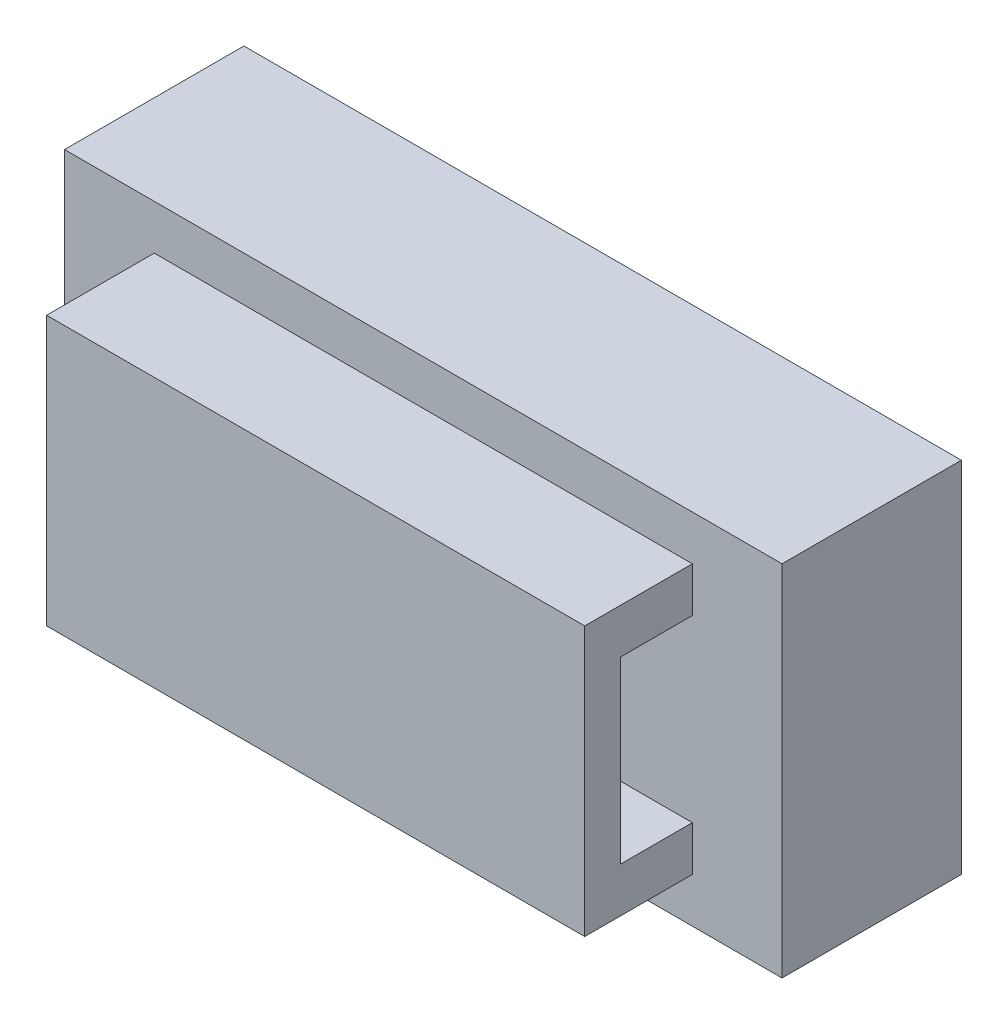
ISO-10303-21;
HEADER;
FILE_DESCRIPTION(('STEP AP214'),'2;1');
FILE_NAME('part.step','',(''),(''),'','','');
FILE_SCHEMA(('AUTOMOTIVE_DESIGN { 1 0 10303 214 1 1 1 1 }'));
ENDSEC;
DATA;
#1=APPLICATION_CONTEXT('core data for automotive mechanical design processes');
#2=APPLICATION_PROTOCOL_DEFINITION('international standard','automotive_design',2000,#1);
#3=PRODUCT_CONTEXT('',#1,'mechanical');
#4=PRODUCT('Part','Part','',(#3));
#5=PRODUCT_RELATED_PRODUCT_CATEGORY('part','',(#4));
#6=PRODUCT_DEFINITION_FORMATION('','',#4);
#7=PRODUCT_DEFINITION_CONTEXT('part definition',#1,'design');
#8=PRODUCT_DEFINITION('design','',#6,#7);
#9=PRODUCT_DEFINITION_SHAPE('','',#8);
#10=(LENGTH_UNIT() NAMED_UNIT(*) SI_UNIT(.MILLI.,.METRE.));
#11=(NAMED_UNIT(*) PLANE_ANGLE_UNIT() SI_UNIT($,.RADIAN.));
#12=(NAMED_UNIT(*) SI_UNIT($,.STERADIAN.) SOLID_ANGLE_UNIT());
#13=UNCERTAINTY_MEASURE_WITH_UNIT(LENGTH_MEASURE(1.E-05),#10,'distance_accuracy_value','');
#14=(GEOMETRIC_REPRESENTATION_CONTEXT(3) GLOBAL_UNCERTAINTY_ASSIGNED_CONTEXT((#13)) GLOBAL_UNIT_ASSIGNED_CONTEXT((#10,
#11,#12)) REPRESENTATION_CONTEXT('',''));
#15=CARTESIAN_POINT('',(0.,0.,0.));
#16=DIRECTION('',(0.,0.,1.));
#17=DIRECTION('',(1.,0.,0.));
#18=AXIS2_PLACEMENT_3D('',#15,#16,#17);
#19=CARTESIAN_POINT('',(20.,-10.,10.));
#20=DIRECTION('',(0.,0.,1.));
#21=DIRECTION('',(1.,0.,0.));
#22=AXIS2_PLACEMENT_3D('',#19,#20,#21);
#23=PLANE('',#22);
#24=DIRECTION('',(0.,-1.,0.));
#25=VECTOR('',#24,1.);
#26=CARTESIAN_POINT('',(-15.,7.5,10.));
#27=LINE('',#26,#25);
#28=CARTESIAN_POINT('',(-15.,-5.,10.));
#29=VERTEX_POINT('',#28);
#30=CARTESIAN_POINT('',(-15.,-7.5,10.));
#31=VERTEX_POINT('',#30);
#32=EDGE_CURVE('E159',#29,#31,#27,.T.);
#33=ORIENTED_EDGE('',*,*,#32,.F.);
#34=DIRECTION('',(1.,0.,0.));
#35=VECTOR('',#34,1.);
#36=CARTESIAN_POINT('',(-25.,-5.,10.));
#37=LINE('',#36,#35);
#38=CARTESIAN_POINT('',(15.,-5.,10.));
#39=VERTEX_POINT('',#38);
#40=EDGE_CURVE('E139',#29,#39,#37,.T.);
#41=ORIENTED_EDGE('',*,*,#40,.T.);
#42=DIRECTION('',(0.,1.,0.));
#43=VECTOR('',#42,1.);
#44=CARTESIAN_POINT('',(15.,7.5,10.));
#45=LINE('',#44,#43);
#46=CARTESIAN_POINT('',(15.,-7.5,10.));
#47=VERTEX_POINT('',#46);
#48=EDGE_CURVE('E155',#47,#39,#45,.T.);
#49=ORIENTED_EDGE('',*,*,#48,.F.);
#50=DIRECTION('',(1.,0.,0.));
#51=VECTOR('',#50,1.);
#52=CARTESIAN_POINT('',(-15.,-7.5,10.));
#53=LINE('',#52,#51);
#54=EDGE_CURVE('E148',#31,#47,#53,.T.);
#55=ORIENTED_EDGE('',*,*,#54,.F.);
#56=EDGE_LOOP('',(#33,#41,#49,#55));
#57=FACE_BOUND('',#56,.T.);
#58=DIRECTION('',(0.,-1.,0.));
#59=VECTOR('',#58,1.);
#60=CARTESIAN_POINT('',(-20.,10.,10.));
#61=LINE('',#60,#59);
#62=CARTESIAN_POINT('',(-20.,10.,10.));
#63=VERTEX_POINT('',#62);
#64=CARTESIAN_POINT('',(-20.,-10.,10.));
#65=VERTEX_POINT('',#64);
#66=EDGE_CURVE('E182',#63,#65,#61,.T.);
#67=ORIENTED_EDGE('',*,*,#66,.T.);
#68=DIRECTION('',(1.,0.,0.));
#69=VECTOR('',#68,1.);
#70=CARTESIAN_POINT('',(-20.,-10.,10.));
#71=LINE('',#70,#69);
#72=CARTESIAN_POINT('',(20.,-10.,10.));
#73=VERTEX_POINT('',#72);
#74=EDGE_CURVE('E184',#65,#73,#71,.T.);
#75=ORIENTED_EDGE('',*,*,#74,.T.);
#76=DIRECTION('',(0.,1.,0.));
#77=VECTOR('',#76,1.);
#78=CARTESIAN_POINT('',(20.,10.,10.));
#79=LINE('',#78,#77);
#80=CARTESIAN_POINT('',(20.,10.,10.));
#81=VERTEX_POINT('',#80);
#82=EDGE_CURVE('E176',#73,#81,#79,.T.);
#83=ORIENTED_EDGE('',*,*,#82,.T.);
#84=DIRECTION('',(-1.,0.,0.));
#85=VECTOR('',#84,1.);
#86=CARTESIAN_POINT('',(-20.,10.,10.));
#87=LINE('',#86,#85);
#88=EDGE_CURVE('E179',#81,#63,#87,.T.);
#89=ORIENTED_EDGE('',*,*,#88,.T.);
#90=EDGE_LOOP('',(#67,#75,#83,#89));
#91=FACE_BOUND('',#90,.T.);
#92=DIRECTION('',(1.,0.,0.));
#93=VECTOR('',#92,1.);
#94=CARTESIAN_POINT('',(-25.,5.,10.));
#95=LINE('',#94,#93);
#96=CARTESIAN_POINT('',(-15.,5.,10.));
#97=VERTEX_POINT('',#96);
#98=CARTESIAN_POINT('',(15.,5.,10.));
#99=VERTEX_POINT('',#98);
#100=EDGE_CURVE('E46',#97,#99,#95,.T.);
#101=ORIENTED_EDGE('',*,*,#100,.F.);
#102=CARTESIAN_POINT('',(-15.,7.5,10.));
#103=VERTEX_POINT('',#102);
#104=EDGE_CURVE('E160',#103,#97,#27,.T.);
#105=ORIENTED_EDGE('',*,*,#104,.F.);
#106=DIRECTION('',(-1.,0.,0.));
#107=VECTOR('',#106,1.);
#108=CARTESIAN_POINT('',(-15.,7.5,10.));
#109=LINE('',#108,#107);
#110=CARTESIAN_POINT('',(15.,7.5,10.));
#111=VERTEX_POINT('',#110);
#112=EDGE_CURVE('E157',#111,#103,#109,.T.);
#113=ORIENTED_EDGE('',*,*,#112,.F.);
#114=EDGE_CURVE('E141',#99,#111,#45,.T.);
#115=ORIENTED_EDGE('',*,*,#114,.F.);
#116=EDGE_LOOP('',(#101,#105,#113,#115));
#117=FACE_BOUND('',#116,.T.);
#118=ADVANCED_FACE('F31',(#57,#91,#117),#23,.T.);
#119=CARTESIAN_POINT('',(20.,10.,10.));
#120=DIRECTION('',(-1.,0.,0.));
#121=DIRECTION('',(0.,0.,1.));
#122=AXIS2_PLACEMENT_3D('',#119,#120,#121);
#123=PLANE('',#122);
#124=DIRECTION('',(0.,1.,0.));
#125=VECTOR('',#124,1.);
#126=CARTESIAN_POINT('',(20.,10.,0.));
#127=LINE('',#126,#125);
#128=CARTESIAN_POINT('',(20.,-10.,0.));
#129=VERTEX_POINT('',#128);
#130=CARTESIAN_POINT('',(20.,10.,0.));
#131=VERTEX_POINT('',#130);
#132=EDGE_CURVE('E175',#129,#131,#127,.T.);
#133=ORIENTED_EDGE('',*,*,#132,.T.);
#134=DIRECTION('',(0.,0.,-1.));
#135=VECTOR('',#134,1.);
#136=CARTESIAN_POINT('',(20.,10.,10.));
#137=LINE('',#136,#135);
#138=EDGE_CURVE('E202',#81,#131,#137,.T.);
#139=ORIENTED_EDGE('',*,*,#138,.F.);
#140=ORIENTED_EDGE('',*,*,#82,.F.);
#141=DIRECTION('',(0.,0.,-1.));
#142=VECTOR('',#141,1.);
#143=CARTESIAN_POINT('',(20.,-10.,10.));
#144=LINE('',#143,#142);
#145=EDGE_CURVE('E186',#73,#129,#144,.T.);
#146=ORIENTED_EDGE('',*,*,#145,.T.);
#147=EDGE_LOOP('',(#133,#139,#140,#146));
#148=FACE_BOUND('',#147,.T.);
#149=ADVANCED_FACE('F33',(#148),#123,.F.);
#150=CARTESIAN_POINT('',(-20.,10.,10.));
#151=DIRECTION('',(0.,-1.,0.));
#152=DIRECTION('',(0.,0.,-1.));
#153=AXIS2_PLACEMENT_3D('',#150,#151,#152);
#154=PLANE('',#153);
#155=DIRECTION('',(-1.,0.,0.));
#156=VECTOR('',#155,1.);
#157=CARTESIAN_POINT('',(-20.,10.,0.));
#158=LINE('',#157,#156);
#159=CARTESIAN_POINT('',(-20.,10.,0.));
#160=VERTEX_POINT('',#159);
#161=EDGE_CURVE('E189',#131,#160,#158,.T.);
#162=ORIENTED_EDGE('',*,*,#161,.T.);
#163=DIRECTION('',(0.,0.,-1.));
#164=VECTOR('',#163,1.);
#165=CARTESIAN_POINT('',(-20.,10.,10.));
#166=LINE('',#165,#164);
#167=EDGE_CURVE('E199',#63,#160,#166,.T.);
#168=ORIENTED_EDGE('',*,*,#167,.F.);
#169=ORIENTED_EDGE('',*,*,#88,.F.);
#170=ORIENTED_EDGE('',*,*,#138,.T.);
#171=EDGE_LOOP('',(#162,#168,#169,#170));
#172=FACE_BOUND('',#171,.T.);
#173=ADVANCED_FACE('F243',(#172),#154,.F.);
#174=CARTESIAN_POINT('',(-20.,10.,10.));
#175=DIRECTION('',(1.,0.,0.));
#176=DIRECTION('',(0.,1.,0.));
#177=AXIS2_PLACEMENT_3D('',#174,#175,#176);
#178=PLANE('',#177);
#179=DIRECTION('',(0.,-1.,0.));
#180=VECTOR('',#179,1.);
#181=CARTESIAN_POINT('',(-20.,10.,0.));
#182=LINE('',#181,#180);
#183=CARTESIAN_POINT('',(-20.,-10.,0.));
#184=VERTEX_POINT('',#183);
#185=EDGE_CURVE('E191',#160,#184,#182,.T.);
#186=ORIENTED_EDGE('',*,*,#185,.T.);
#187=DIRECTION('',(0.,0.,-1.));
#188=VECTOR('',#187,1.);
#189=CARTESIAN_POINT('',(-20.,-10.,10.));
#190=LINE('',#189,#188);
#191=EDGE_CURVE('E196',#65,#184,#190,.T.);
#192=ORIENTED_EDGE('',*,*,#191,.F.);
#193=ORIENTED_EDGE('',*,*,#66,.F.);
#194=ORIENTED_EDGE('',*,*,#167,.T.);
#195=EDGE_LOOP('',(#186,#192,#193,#194));
#196=FACE_BOUND('',#195,.T.);
#197=ADVANCED_FACE('F255',(#196),#178,.F.);
#198=CARTESIAN_POINT('',(-20.,-10.,10.));
#199=DIRECTION('',(0.,1.,0.));
#200=DIRECTION('',(0.,0.,1.));
#201=AXIS2_PLACEMENT_3D('',#198,#199,#200);
#202=PLANE('',#201);
#203=DIRECTION('',(1.,0.,0.));
#204=VECTOR('',#203,1.);
#205=CARTESIAN_POINT('',(-20.,-10.,0.));
#206=LINE('',#205,#204);
#207=EDGE_CURVE('E180',#184,#129,#206,.T.);
#208=ORIENTED_EDGE('',*,*,#207,.T.);
#209=ORIENTED_EDGE('',*,*,#145,.F.);
#210=ORIENTED_EDGE('',*,*,#74,.F.);
#211=ORIENTED_EDGE('',*,*,#191,.T.);
#212=EDGE_LOOP('',(#208,#209,#210,#211));
#213=FACE_BOUND('',#212,.T.);
#214=ADVANCED_FACE('F251',(#213),#202,.F.);
#215=CARTESIAN_POINT('',(20.,-10.,0.));
#216=DIRECTION('',(0.,0.,1.));
#217=DIRECTION('',(1.,0.,0.));
#218=AXIS2_PLACEMENT_3D('',#215,#216,#217);
#219=PLANE('',#218);
#220=ORIENTED_EDGE('',*,*,#132,.F.);
#221=ORIENTED_EDGE('',*,*,#207,.F.);
#222=ORIENTED_EDGE('',*,*,#185,.F.);
#223=ORIENTED_EDGE('',*,*,#161,.F.);
#224=EDGE_LOOP('',(#220,#221,#222,#223));
#225=FACE_BOUND('',#224,.T.);
#226=ADVANCED_FACE('F248',(#225),#219,.F.);
#227=CARTESIAN_POINT('',(15.,7.5,16.));
#228=DIRECTION('',(-1.,0.,0.));
#229=DIRECTION('',(0.,0.,1.));
#230=AXIS2_PLACEMENT_3D('',#227,#228,#229);
#231=PLANE('',#230);
#232=ORIENTED_EDGE('',*,*,#48,.T.);
#233=DIRECTION('',(0.,0.,-1.));
#234=VECTOR('',#233,1.);
#235=CARTESIAN_POINT('',(15.,-5.,10.));
#236=LINE('',#235,#234);
#237=CARTESIAN_POINT('',(15.,-5.,14.));
#238=VERTEX_POINT('',#237);
#239=EDGE_CURVE('E135',#238,#39,#236,.T.);
#240=ORIENTED_EDGE('',*,*,#239,.F.);
#241=DIRECTION('',(0.,-1.,0.));
#242=VECTOR('',#241,1.);
#243=CARTESIAN_POINT('',(15.,-5.,14.));
#244=LINE('',#243,#242);
#245=CARTESIAN_POINT('',(15.,5.,14.));
#246=VERTEX_POINT('',#245);
#247=EDGE_CURVE('E121',#246,#238,#244,.T.);
#248=ORIENTED_EDGE('',*,*,#247,.F.);
#249=DIRECTION('',(0.,0.,1.));
#250=VECTOR('',#249,1.);
#251=CARTESIAN_POINT('',(15.,5.,10.));
#252=LINE('',#251,#250);
#253=EDGE_CURVE('E127',#99,#246,#252,.T.);
#254=ORIENTED_EDGE('',*,*,#253,.F.);
#255=ORIENTED_EDGE('',*,*,#114,.T.);
#256=DIRECTION('',(0.,0.,-1.));
#257=VECTOR('',#256,1.);
#258=CARTESIAN_POINT('',(15.,7.5,16.));
#259=LINE('',#258,#257);
#260=CARTESIAN_POINT('',(15.,7.5,16.));
#261=VERTEX_POINT('',#260);
#262=EDGE_CURVE('E172',#261,#111,#259,.T.);
#263=ORIENTED_EDGE('',*,*,#262,.F.);
#264=DIRECTION('',(0.,1.,0.));
#265=VECTOR('',#264,1.);
#266=CARTESIAN_POINT('',(15.,7.5,16.));
#267=LINE('',#266,#265);
#268=CARTESIAN_POINT('',(15.,-7.5,16.));
#269=VERTEX_POINT('',#268);
#270=EDGE_CURVE('E144',#269,#261,#267,.T.);
#271=ORIENTED_EDGE('',*,*,#270,.F.);
#272=DIRECTION('',(0.,0.,-1.));
#273=VECTOR('',#272,1.);
#274=CARTESIAN_POINT('',(15.,-7.5,16.));
#275=LINE('',#274,#273);
#276=EDGE_CURVE('E154',#269,#47,#275,.T.);
#277=ORIENTED_EDGE('',*,*,#276,.T.);
#278=EDGE_LOOP('',(#232,#240,#248,#254,#255,#263,#271,#277));
#279=FACE_BOUND('',#278,.T.);
#280=ADVANCED_FACE('F133',(#279),#231,.F.);
#281=CARTESIAN_POINT('',(-15.,7.5,16.));
#282=DIRECTION('',(0.,-1.,0.));
#283=DIRECTION('',(0.,0.,-1.));
#284=AXIS2_PLACEMENT_3D('',#281,#282,#283);
#285=PLANE('',#284);
#286=ORIENTED_EDGE('',*,*,#112,.T.);
#287=DIRECTION('',(0.,0.,-1.));
#288=VECTOR('',#287,1.);
#289=CARTESIAN_POINT('',(-15.,7.5,16.));
#290=LINE('',#289,#288);
#291=CARTESIAN_POINT('',(-15.,7.5,16.));
#292=VERTEX_POINT('',#291);
#293=EDGE_CURVE('E169',#292,#103,#290,.T.);
#294=ORIENTED_EDGE('',*,*,#293,.F.);
#295=DIRECTION('',(-1.,0.,0.));
#296=VECTOR('',#295,1.);
#297=CARTESIAN_POINT('',(-15.,7.5,16.));
#298=LINE('',#297,#296);
#299=EDGE_CURVE('E147',#261,#292,#298,.T.);
#300=ORIENTED_EDGE('',*,*,#299,.F.);
#301=ORIENTED_EDGE('',*,*,#262,.T.);
#302=EDGE_LOOP('',(#286,#294,#300,#301));
#303=FACE_BOUND('',#302,.T.);
#304=ADVANCED_FACE('F215',(#303),#285,.F.);
#305=CARTESIAN_POINT('',(-15.,7.5,16.));
#306=DIRECTION('',(1.,0.,0.));
#307=DIRECTION('',(0.,0.,-1.));
#308=AXIS2_PLACEMENT_3D('',#305,#306,#307);
#309=PLANE('',#308);
#310=DIRECTION('',(0.,-1.,0.));
#311=VECTOR('',#310,1.);
#312=CARTESIAN_POINT('',(-15.,7.5,14.));
#313=LINE('',#312,#311);
#314=CARTESIAN_POINT('',(-15.,5.,14.));
#315=VERTEX_POINT('',#314);
#316=CARTESIAN_POINT('',(-15.,-5.,14.));
#317=VERTEX_POINT('',#316);
#318=EDGE_CURVE('E39',#315,#317,#313,.T.);
#319=ORIENTED_EDGE('',*,*,#318,.T.);
#320=DIRECTION('',(0.,0.,-1.));
#321=VECTOR('',#320,1.);
#322=CARTESIAN_POINT('',(-15.,-5.,16.));
#323=LINE('',#322,#321);
#324=EDGE_CURVE('E11',#317,#29,#323,.T.);
#325=ORIENTED_EDGE('',*,*,#324,.T.);
#326=ORIENTED_EDGE('',*,*,#32,.T.);
#327=DIRECTION('',(0.,0.,-1.));
#328=VECTOR('',#327,1.);
#329=CARTESIAN_POINT('',(-15.,-7.5,16.));
#330=LINE('',#329,#328);
#331=CARTESIAN_POINT('',(-15.,-7.5,16.));
#332=VERTEX_POINT('',#331);
#333=EDGE_CURVE('E166',#332,#31,#330,.T.);
#334=ORIENTED_EDGE('',*,*,#333,.F.);
#335=DIRECTION('',(0.,-1.,0.));
#336=VECTOR('',#335,1.);
#337=CARTESIAN_POINT('',(-15.,7.5,16.));
#338=LINE('',#337,#336);
#339=EDGE_CURVE('E150',#292,#332,#338,.T.);
#340=ORIENTED_EDGE('',*,*,#339,.F.);
#341=ORIENTED_EDGE('',*,*,#293,.T.);
#342=ORIENTED_EDGE('',*,*,#104,.T.);
#343=DIRECTION('',(0.,0.,1.));
#344=VECTOR('',#343,1.);
#345=CARTESIAN_POINT('',(-15.,5.,16.));
#346=LINE('',#345,#344);
#347=EDGE_CURVE('E205',#97,#315,#346,.T.);
#348=ORIENTED_EDGE('',*,*,#347,.T.);
#349=EDGE_LOOP('',(#319,#325,#326,#334,#340,#341,#342,#348));
#350=FACE_BOUND('',#349,.T.);
#351=ADVANCED_FACE('F207',(#350),#309,.F.);
#352=CARTESIAN_POINT('',(-15.,-7.5,16.));
#353=DIRECTION('',(0.,1.,0.));
#354=DIRECTION('',(0.,0.,1.));
#355=AXIS2_PLACEMENT_3D('',#352,#353,#354);
#356=PLANE('',#355);
#357=ORIENTED_EDGE('',*,*,#54,.T.);
#358=ORIENTED_EDGE('',*,*,#276,.F.);
#359=DIRECTION('',(1.,0.,0.));
#360=VECTOR('',#359,1.);
#361=CARTESIAN_POINT('',(-15.,-7.5,16.));
#362=LINE('',#361,#360);
#363=EDGE_CURVE('E152',#332,#269,#362,.T.);
#364=ORIENTED_EDGE('',*,*,#363,.F.);
#365=ORIENTED_EDGE('',*,*,#333,.T.);
#366=EDGE_LOOP('',(#357,#358,#364,#365));
#367=FACE_BOUND('',#366,.T.);
#368=ADVANCED_FACE('F236',(#367),#356,.F.);
#369=CARTESIAN_POINT('',(15.,-7.5,16.));
#370=DIRECTION('',(0.,0.,1.));
#371=DIRECTION('',(1.,0.,0.));
#372=AXIS2_PLACEMENT_3D('',#369,#370,#371);
#373=PLANE('',#372);
#374=ORIENTED_EDGE('',*,*,#270,.T.);
#375=ORIENTED_EDGE('',*,*,#299,.T.);
#376=ORIENTED_EDGE('',*,*,#339,.T.);
#377=ORIENTED_EDGE('',*,*,#363,.T.);
#378=EDGE_LOOP('',(#374,#375,#376,#377));
#379=FACE_BOUND('',#378,.T.);
#380=ADVANCED_FACE('F219',(#379),#373,.T.);
#381=CARTESIAN_POINT('',(-25.,-5.,10.));
#382=DIRECTION('',(0.,-1.,0.));
#383=DIRECTION('',(0.,0.,-1.));
#384=AXIS2_PLACEMENT_3D('',#381,#382,#383);
#385=PLANE('',#384);
#386=DIRECTION('',(1.,0.,0.));
#387=VECTOR('',#386,1.);
#388=CARTESIAN_POINT('',(-25.,-5.,14.));
#389=LINE('',#388,#387);
#390=EDGE_CURVE('E125',#317,#238,#389,.T.);
#391=ORIENTED_EDGE('',*,*,#390,.T.);
#392=ORIENTED_EDGE('',*,*,#239,.T.);
#393=ORIENTED_EDGE('',*,*,#40,.F.);
#394=ORIENTED_EDGE('',*,*,#324,.F.);
#395=EDGE_LOOP('',(#391,#392,#393,#394));
#396=FACE_BOUND('',#395,.T.);
#397=ADVANCED_FACE('F228',(#396),#385,.F.);
#398=CARTESIAN_POINT('',(-25.,-5.,14.));
#399=DIRECTION('',(0.,0.,1.));
#400=DIRECTION('',(1.,0.,0.));
#401=AXIS2_PLACEMENT_3D('',#398,#399,#400);
#402=PLANE('',#401);
#403=DIRECTION('',(1.,0.,0.));
#404=VECTOR('',#403,1.);
#405=CARTESIAN_POINT('',(-25.,5.,14.));
#406=LINE('',#405,#404);
#407=EDGE_CURVE('E51',#315,#246,#406,.T.);
#408=ORIENTED_EDGE('',*,*,#407,.T.);
#409=ORIENTED_EDGE('',*,*,#247,.T.);
#410=ORIENTED_EDGE('',*,*,#390,.F.);
#411=ORIENTED_EDGE('',*,*,#318,.F.);
#412=EDGE_LOOP('',(#408,#409,#410,#411));
#413=FACE_BOUND('',#412,.T.);
#414=ADVANCED_FACE('F118',(#413),#402,.F.);
#415=CARTESIAN_POINT('',(-25.,5.,10.));
#416=DIRECTION('',(0.,1.,0.));
#417=DIRECTION('',(0.,0.,1.));
#418=AXIS2_PLACEMENT_3D('',#415,#416,#417);
#419=PLANE('',#418);
#420=ORIENTED_EDGE('',*,*,#100,.T.);
#421=ORIENTED_EDGE('',*,*,#253,.T.);
#422=ORIENTED_EDGE('',*,*,#407,.F.);
#423=ORIENTED_EDGE('',*,*,#347,.F.);
#424=EDGE_LOOP('',(#420,#421,#422,#423));
#425=FACE_BOUND('',#424,.T.);
#426=ADVANCED_FACE('F128',(#425),#419,.F.);
#427=CLOSED_SHELL('',(#118,#149,#173,#197,#214,#226,#280,#304,#351,#368,#380,#397,#414,#426));
#428=MANIFOLD_SOLID_BREP('B2',#427);
#429=ADVANCED_BREP_SHAPE_REPRESENTATION('',(#18,#428),#14);
#430=SHAPE_DEFINITION_REPRESENTATION(#9,#429);
ENDSEC;
END-ISO-10303-21;
